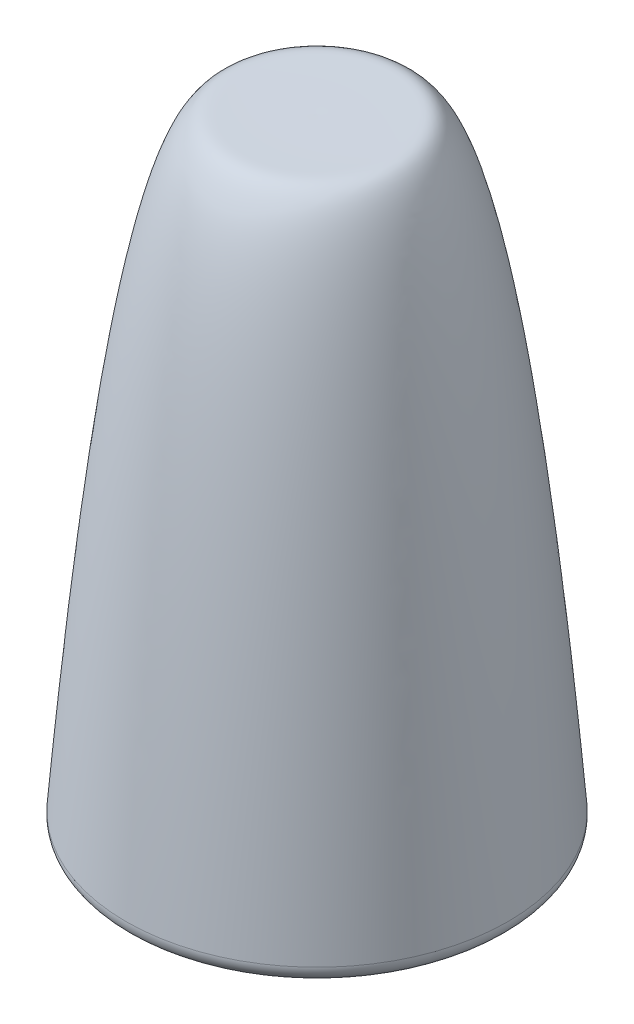
ISO-10303-21;
HEADER;
FILE_DESCRIPTION(('STEP AP214'),'2;1');
FILE_NAME('part.step','',(''),(''),'','','');
FILE_SCHEMA(('AUTOMOTIVE_DESIGN { 1 0 10303 214 1 1 1 1 }'));
ENDSEC;
DATA;
#1=APPLICATION_CONTEXT('core data for automotive mechanical design processes');
#2=APPLICATION_PROTOCOL_DEFINITION('international standard','automotive_design',2000,#1);
#3=PRODUCT_CONTEXT('',#1,'mechanical');
#4=PRODUCT('Part','Part','',(#3));
#5=PRODUCT_RELATED_PRODUCT_CATEGORY('part','',(#4));
#6=PRODUCT_DEFINITION_FORMATION('','',#4);
#7=PRODUCT_DEFINITION_CONTEXT('part definition',#1,'design');
#8=PRODUCT_DEFINITION('design','',#6,#7);
#9=PRODUCT_DEFINITION_SHAPE('','',#8);
#10=(LENGTH_UNIT() NAMED_UNIT(*) SI_UNIT(.MILLI.,.METRE.));
#11=(NAMED_UNIT(*) PLANE_ANGLE_UNIT() SI_UNIT($,.RADIAN.));
#12=(NAMED_UNIT(*) SI_UNIT($,.STERADIAN.) SOLID_ANGLE_UNIT());
#13=UNCERTAINTY_MEASURE_WITH_UNIT(LENGTH_MEASURE(1.E-05),#10,'distance_accuracy_value','');
#14=(GEOMETRIC_REPRESENTATION_CONTEXT(3) GLOBAL_UNCERTAINTY_ASSIGNED_CONTEXT((#13)) GLOBAL_UNIT_ASSIGNED_CONTEXT((#10,
#11,#12)) REPRESENTATION_CONTEXT('',''));
#15=CARTESIAN_POINT('',(0.,0.,0.));
#16=DIRECTION('',(0.,0.,1.));
#17=DIRECTION('',(1.,0.,0.));
#18=AXIS2_PLACEMENT_3D('',#15,#16,#17);
#19=CARTESIAN_POINT('',(0.,0.,0.));
#20=DIRECTION('',(0.,1.,0.));
#21=DIRECTION('',(-1.,0.,0.));
#22=AXIS2_PLACEMENT_3D('',#19,#20,#21);
#23=PLANE('',#22);
#24=CARTESIAN_POINT('',(0.,0.,0.));
#25=DIRECTION('',(0.,-1.,0.));
#26=DIRECTION('',(1.,0.,0.));
#27=AXIS2_PLACEMENT_3D('',#24,#25,#26);
#28=CIRCLE('',#27,1.5);
#29=CARTESIAN_POINT('',(1.5,0.,0.));
#30=VERTEX_POINT('',#29);
#31=EDGE_CURVE('E60',#30,#30,#28,.T.);
#32=ORIENTED_EDGE('',*,*,#31,.F.);
#33=EDGE_LOOP('',(#32));
#34=FACE_BOUND('',#33,.T.);
#35=CARTESIAN_POINT('',(0.,0.,0.));
#36=DIRECTION('',(0.,1.,0.));
#37=DIRECTION('',(-1.,0.,0.));
#38=AXIS2_PLACEMENT_3D('',#35,#36,#37);
#39=CIRCLE('',#38,5.65912920810492);
#40=CARTESIAN_POINT('',(-5.65912920810492,0.,0.));
#41=VERTEX_POINT('',#40);
#42=EDGE_CURVE('E11',#41,#41,#39,.F.);
#43=ORIENTED_EDGE('',*,*,#42,.T.);
#44=EDGE_LOOP('',(#43));
#45=FACE_BOUND('',#44,.T.);
#46=ADVANCED_FACE('F31',(#34,#45),#23,.F.);
#47=CARTESIAN_POINT('',(6.2,0.,0.));
#48=CARTESIAN_POINT('',(5.07224731005012,14.4719388068067,0.));
#49=CARTESIAN_POINT('',(3.66524109383751,20.0633203599366,0.));
#50=CARTESIAN_POINT('',(1.96743872217908,19.9986042705107,0.));
#51=CARTESIAN_POINT('',(0.432351954972115,20.0048322827186,0.));
#52=CARTESIAN_POINT('',(0.,20.,0.));
#53=B_SPLINE_CURVE_WITH_KNOTS('',3,(#47,#48,#49,#50,#51,#52),.UNSPECIFIED.,.F.,.F.,(4,1,1,4),
(0.,0.611398656644162,0.711398656644162,1.),.UNSPECIFIED.);
#54=CARTESIAN_POINT('',(0.,20.,0.));
#55=DIRECTION('',(0.,1.,0.));
#56=AXIS1_PLACEMENT('',#54,#55);
#57=SURFACE_OF_REVOLUTION('',#53,#56);
#58=CARTESIAN_POINT('',(0.,0.539570453024916,0.));
#59=DIRECTION('',(0.,1.,0.));
#60=DIRECTION('',(-1.,0.,0.));
#61=AXIS2_PLACEMENT_3D('',#58,#59,#60);
#62=CIRCLE('',#61,6.15756092784936);
#63=CARTESIAN_POINT('',(-6.15756092784936,0.539570453024916,0.));
#64=VERTEX_POINT('',#63);
#65=EDGE_CURVE('E38',#64,#64,#62,.T.);
#66=ORIENTED_EDGE('',*,*,#65,.T.);
#67=EDGE_LOOP('',(#66));
#68=FACE_BOUND('',#67,.T.);
#69=CARTESIAN_POINT('',(0.,20.,0.));
#70=VERTEX_POINT('',#69);
#71=VERTEX_LOOP('',#70);
#72=FACE_BOUND('',#71,.T.);
#73=ADVANCED_FACE('F41',(#68,#72),#57,.T.);
#74=CARTESIAN_POINT('',(0.,0.5,0.));
#75=DIRECTION('',(0.,1.,0.));
#76=DIRECTION('',(-1.,0.,0.));
#77=AXIS2_PLACEMENT_3D('',#74,#75,#76);
#78=TOROIDAL_SURFACE('',#77,5.65912920810492,0.5);
#79=ORIENTED_EDGE('',*,*,#42,.F.);
#80=EDGE_LOOP('',(#79));
#81=FACE_BOUND('',#80,.T.);
#82=ORIENTED_EDGE('',*,*,#65,.F.);
#83=EDGE_LOOP('',(#82));
#84=FACE_BOUND('',#83,.T.);
#85=ADVANCED_FACE('F33',(#81,#84),#78,.T.);
#86=CARTESIAN_POINT('',(0.,5.,0.));
#87=DIRECTION('',(0.,-1.,0.));
#88=DIRECTION('',(1.,0.,0.));
#89=AXIS2_PLACEMENT_3D('',#86,#87,#88);
#90=CYLINDRICAL_SURFACE('',#89,1.5);
#91=CARTESIAN_POINT('',(0.,5.,0.));
#92=DIRECTION('',(0.,-1.,0.));
#93=DIRECTION('',(1.,0.,0.));
#94=AXIS2_PLACEMENT_3D('',#91,#92,#93);
#95=CIRCLE('',#94,1.5);
#96=CARTESIAN_POINT('',(1.50000000000001,5.,0.));
#97=VERTEX_POINT('',#96);
#98=EDGE_CURVE('E65',#97,#97,#95,.T.);
#99=ORIENTED_EDGE('',*,*,#98,.F.);
#100=EDGE_LOOP('',(#99));
#101=FACE_BOUND('',#100,.T.);
#102=ORIENTED_EDGE('',*,*,#31,.T.);
#103=EDGE_LOOP('',(#102));
#104=FACE_BOUND('',#103,.T.);
#105=ADVANCED_FACE('F49',(#101,#104),#90,.F.);
#106=CARTESIAN_POINT('',(0.,5.,0.));
#107=DIRECTION('',(0.,-1.,0.));
#108=DIRECTION('',(1.,0.,0.));
#109=AXIS2_PLACEMENT_3D('',#106,#107,#108);
#110=PLANE('',#109);
#111=ORIENTED_EDGE('',*,*,#98,.T.);
#112=EDGE_LOOP('',(#111));
#113=FACE_BOUND('',#112,.T.);
#114=ADVANCED_FACE('F77',(#113),#110,.T.);
#115=CLOSED_SHELL('',(#46,#73,#85,#105,#114));
#116=MANIFOLD_SOLID_BREP('B2',#115);
#117=ADVANCED_BREP_SHAPE_REPRESENTATION('',(#18,#116),#14);
#118=SHAPE_DEFINITION_REPRESENTATION(#9,#117);
ENDSEC;
END-ISO-10303-21;
